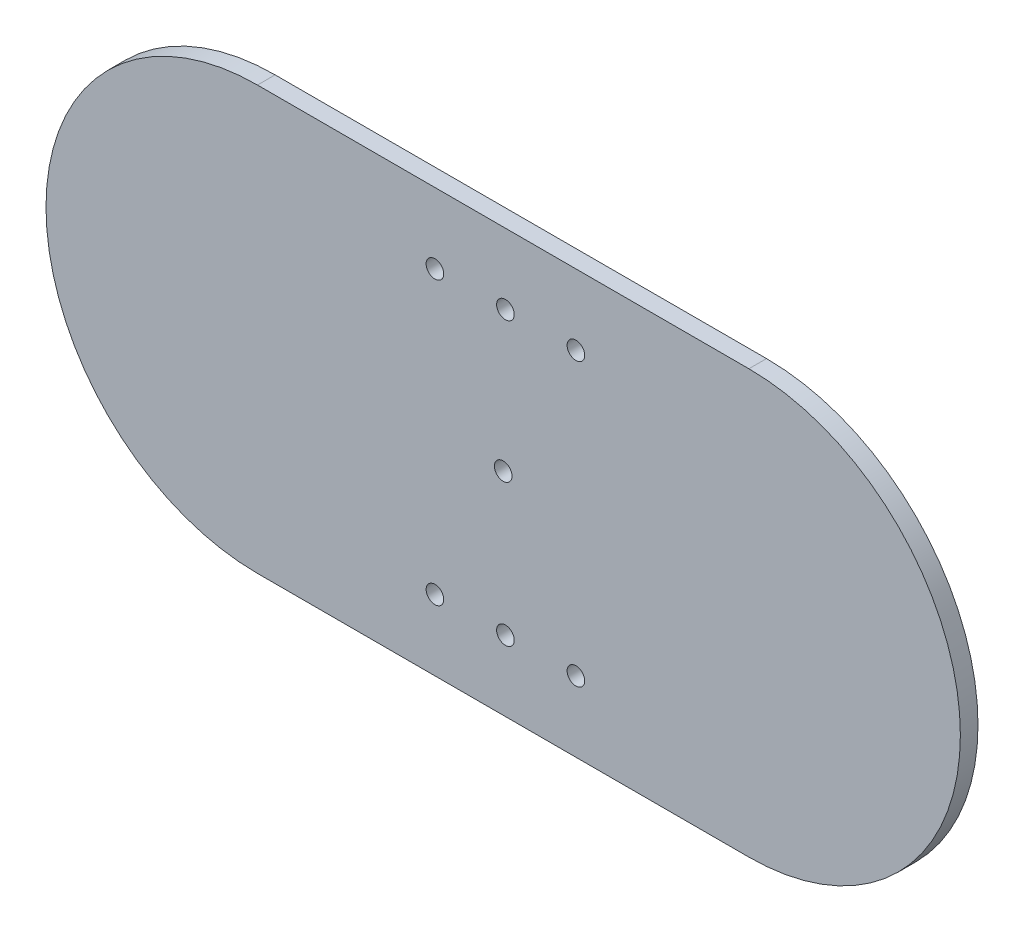
ISO-10303-21;
HEADER;
FILE_DESCRIPTION(('STEP AP214'),'2;1');
FILE_NAME('part.step','',(''),(''),'','','');
FILE_SCHEMA(('AUTOMOTIVE_DESIGN { 1 0 10303 214 1 1 1 1 }'));
ENDSEC;
DATA;
#1=APPLICATION_CONTEXT('core data for automotive mechanical design processes');
#2=APPLICATION_PROTOCOL_DEFINITION('international standard','automotive_design',2000,#1);
#3=PRODUCT_CONTEXT('',#1,'mechanical');
#4=PRODUCT('Part','Part','',(#3));
#5=PRODUCT_RELATED_PRODUCT_CATEGORY('part','',(#4));
#6=PRODUCT_DEFINITION_FORMATION('','',#4);
#7=PRODUCT_DEFINITION_CONTEXT('part definition',#1,'design');
#8=PRODUCT_DEFINITION('design','',#6,#7);
#9=PRODUCT_DEFINITION_SHAPE('','',#8);
#10=(LENGTH_UNIT() NAMED_UNIT(*) SI_UNIT(.MILLI.,.METRE.));
#11=(NAMED_UNIT(*) PLANE_ANGLE_UNIT() SI_UNIT($,.RADIAN.));
#12=(NAMED_UNIT(*) SI_UNIT($,.STERADIAN.) SOLID_ANGLE_UNIT());
#13=UNCERTAINTY_MEASURE_WITH_UNIT(LENGTH_MEASURE(1.E-05),#10,'distance_accuracy_value','');
#14=(GEOMETRIC_REPRESENTATION_CONTEXT(3) GLOBAL_UNCERTAINTY_ASSIGNED_CONTEXT((#13)) GLOBAL_UNIT_ASSIGNED_CONTEXT((#10,
#11,#12)) REPRESENTATION_CONTEXT('',''));
#15=CARTESIAN_POINT('',(0.,0.,0.));
#16=DIRECTION('',(0.,0.,1.));
#17=DIRECTION('',(1.,0.,0.));
#18=AXIS2_PLACEMENT_3D('',#15,#16,#17);
#19=CARTESIAN_POINT('',(-81.1545144804089,0.,6.35));
#20=DIRECTION('',(0.,0.,1.));
#21=DIRECTION('',(1.,0.,0.));
#22=AXIS2_PLACEMENT_3D('',#19,#20,#21);
#23=PLANE('',#22);
#24=CARTESIAN_POINT('',(-17.2157611138345,-50.8,6.35));
#25=DIRECTION('',(0.,0.,1.));
#26=DIRECTION('',(1.,0.,0.));
#27=AXIS2_PLACEMENT_3D('',#24,#25,#26);
#28=CIRCLE('',#27,3.175);
#29=CARTESIAN_POINT('',(-14.0407611138345,-50.8,6.35));
#30=VERTEX_POINT('',#29);
#31=EDGE_CURVE('E147',#30,#30,#28,.T.);
#32=ORIENTED_EDGE('',*,*,#31,.F.);
#33=EDGE_LOOP('',(#32));
#34=FACE_BOUND('',#33,.T.);
#35=CARTESIAN_POINT('',(33.5842388861655,50.8,6.35));
#36=DIRECTION('',(0.,0.,1.));
#37=DIRECTION('',(1.,0.,0.));
#38=AXIS2_PLACEMENT_3D('',#35,#36,#37);
#39=CIRCLE('',#38,3.175);
#40=CARTESIAN_POINT('',(36.7592388861655,50.8,6.35));
#41=VERTEX_POINT('',#40);
#42=EDGE_CURVE('E135',#41,#41,#39,.T.);
#43=ORIENTED_EDGE('',*,*,#42,.F.);
#44=EDGE_LOOP('',(#43));
#45=FACE_BOUND('',#44,.T.);
#46=CARTESIAN_POINT('',(8.18423888616551,-50.8,6.35));
#47=DIRECTION('',(0.,0.,1.));
#48=DIRECTION('',(1.,0.,0.));
#49=AXIS2_PLACEMENT_3D('',#46,#47,#48);
#50=CIRCLE('',#49,3.175);
#51=CARTESIAN_POINT('',(11.3592388861655,-50.8,6.35));
#52=VERTEX_POINT('',#51);
#53=EDGE_CURVE('E123',#52,#52,#50,.T.);
#54=ORIENTED_EDGE('',*,*,#53,.F.);
#55=EDGE_LOOP('',(#54));
#56=FACE_BOUND('',#55,.T.);
#57=CARTESIAN_POINT('',(-81.1545144804089,0.,6.35));
#58=DIRECTION('',(0.,0.,1.));
#59=DIRECTION('',(1.,0.,0.));
#60=AXIS2_PLACEMENT_3D('',#57,#58,#59);
#61=CIRCLE('',#60,76.2);
#62=CARTESIAN_POINT('',(-81.1545144804089,76.2,6.35));
#63=VERTEX_POINT('',#62);
#64=CARTESIAN_POINT('',(-81.1545144804089,-76.2,6.35));
#65=VERTEX_POINT('',#64);
#66=EDGE_CURVE('E93',#63,#65,#61,.T.);
#67=ORIENTED_EDGE('',*,*,#66,.T.);
#68=DIRECTION('',(1.,0.,0.));
#69=VECTOR('',#68,1.);
#70=CARTESIAN_POINT('',(-81.1545144804089,-76.2,6.35));
#71=LINE('',#70,#69);
#72=CARTESIAN_POINT('',(95.9098807495741,-76.2,6.35));
#73=VERTEX_POINT('',#72);
#74=EDGE_CURVE('E88',#65,#73,#71,.T.);
#75=ORIENTED_EDGE('',*,*,#74,.T.);
#76=CARTESIAN_POINT('',(95.9098807495741,0.,6.35));
#77=DIRECTION('',(0.,0.,1.));
#78=DIRECTION('',(1.,0.,0.));
#79=AXIS2_PLACEMENT_3D('',#76,#77,#78);
#80=CIRCLE('',#79,76.2);
#81=CARTESIAN_POINT('',(95.9098807495741,76.2,6.35));
#82=VERTEX_POINT('',#81);
#83=EDGE_CURVE('E91',#73,#82,#80,.T.);
#84=ORIENTED_EDGE('',*,*,#83,.T.);
#85=DIRECTION('',(-1.,0.,0.));
#86=VECTOR('',#85,1.);
#87=CARTESIAN_POINT('',(-81.1545144804089,76.2,6.35));
#88=LINE('',#87,#86);
#89=EDGE_CURVE('E58',#82,#63,#88,.T.);
#90=ORIENTED_EDGE('',*,*,#89,.T.);
#91=EDGE_LOOP('',(#67,#75,#84,#90));
#92=FACE_BOUND('',#91,.T.);
#93=CARTESIAN_POINT('',(8.18423888616551,50.8,6.35));
#94=DIRECTION('',(0.,0.,1.));
#95=DIRECTION('',(1.,0.,0.));
#96=AXIS2_PLACEMENT_3D('',#93,#94,#95);
#97=CIRCLE('',#96,3.175);
#98=CARTESIAN_POINT('',(11.3592388861655,50.8,6.35));
#99=VERTEX_POINT('',#98);
#100=EDGE_CURVE('E108',#99,#99,#97,.T.);
#101=ORIENTED_EDGE('',*,*,#100,.F.);
#102=EDGE_LOOP('',(#101));
#103=FACE_BOUND('',#102,.T.);
#104=CARTESIAN_POINT('',(-17.2157611138345,50.8,6.35));
#105=DIRECTION('',(0.,0.,1.));
#106=DIRECTION('',(1.,0.,0.));
#107=AXIS2_PLACEMENT_3D('',#104,#105,#106);
#108=CIRCLE('',#107,3.175);
#109=CARTESIAN_POINT('',(-14.0407611138345,50.8,6.35));
#110=VERTEX_POINT('',#109);
#111=EDGE_CURVE('E129',#110,#110,#108,.T.);
#112=ORIENTED_EDGE('',*,*,#111,.F.);
#113=EDGE_LOOP('',(#112));
#114=FACE_BOUND('',#113,.T.);
#115=CARTESIAN_POINT('',(33.5842388861655,-50.8,6.35));
#116=DIRECTION('',(0.,0.,1.));
#117=DIRECTION('',(1.,0.,0.));
#118=AXIS2_PLACEMENT_3D('',#115,#116,#117);
#119=CIRCLE('',#118,3.175);
#120=CARTESIAN_POINT('',(36.7592388861655,-50.8,6.35));
#121=VERTEX_POINT('',#120);
#122=EDGE_CURVE('E141',#121,#121,#119,.T.);
#123=ORIENTED_EDGE('',*,*,#122,.F.);
#124=EDGE_LOOP('',(#123));
#125=FACE_BOUND('',#124,.T.);
#126=CARTESIAN_POINT('',(7.3776831345826,0.,6.35));
#127=DIRECTION('',(0.,0.,1.));
#128=DIRECTION('',(1.,0.,0.));
#129=AXIS2_PLACEMENT_3D('',#126,#127,#128);
#130=CIRCLE('',#129,3.175);
#131=CARTESIAN_POINT('',(10.5526831345826,0.,6.35));
#132=VERTEX_POINT('',#131);
#133=EDGE_CURVE('E153',#132,#132,#130,.T.);
#134=ORIENTED_EDGE('',*,*,#133,.F.);
#135=EDGE_LOOP('',(#134));
#136=FACE_BOUND('',#135,.T.);
#137=ADVANCED_FACE('F41',(#34,#45,#56,#92,#103,#114,#125,#136),#23,.T.);
#138=CARTESIAN_POINT('',(-81.1545144804089,0.,0.));
#139=DIRECTION('',(0.,0.,1.));
#140=DIRECTION('',(1.,0.,0.));
#141=AXIS2_PLACEMENT_3D('',#138,#139,#140);
#142=PLANE('',#141);
#143=CARTESIAN_POINT('',(-81.1545144804089,0.,0.));
#144=DIRECTION('',(0.,0.,1.));
#145=DIRECTION('',(1.,0.,0.));
#146=AXIS2_PLACEMENT_3D('',#143,#144,#145);
#147=CIRCLE('',#146,76.2);
#148=CARTESIAN_POINT('',(-81.1545144804089,76.2,0.));
#149=VERTEX_POINT('',#148);
#150=CARTESIAN_POINT('',(-81.1545144804089,-76.2,0.));
#151=VERTEX_POINT('',#150);
#152=EDGE_CURVE('E105',#149,#151,#147,.T.);
#153=ORIENTED_EDGE('',*,*,#152,.F.);
#154=DIRECTION('',(-1.,0.,0.));
#155=VECTOR('',#154,1.);
#156=CARTESIAN_POINT('',(-81.1545144804089,76.2,0.));
#157=LINE('',#156,#155);
#158=CARTESIAN_POINT('',(95.9098807495741,76.2,0.));
#159=VERTEX_POINT('',#158);
#160=EDGE_CURVE('E81',#159,#149,#157,.T.);
#161=ORIENTED_EDGE('',*,*,#160,.F.);
#162=CARTESIAN_POINT('',(95.9098807495741,0.,0.));
#163=DIRECTION('',(0.,0.,1.));
#164=DIRECTION('',(1.,0.,0.));
#165=AXIS2_PLACEMENT_3D('',#162,#163,#164);
#166=CIRCLE('',#165,76.2);
#167=CARTESIAN_POINT('',(95.9098807495741,-76.2,0.));
#168=VERTEX_POINT('',#167);
#169=EDGE_CURVE('E75',#168,#159,#166,.T.);
#170=ORIENTED_EDGE('',*,*,#169,.F.);
#171=DIRECTION('',(1.,0.,0.));
#172=VECTOR('',#171,1.);
#173=CARTESIAN_POINT('',(-81.1545144804089,-76.2,0.));
#174=LINE('',#173,#172);
#175=EDGE_CURVE('E97',#151,#168,#174,.T.);
#176=ORIENTED_EDGE('',*,*,#175,.F.);
#177=EDGE_LOOP('',(#153,#161,#170,#176));
#178=FACE_BOUND('',#177,.T.);
#179=CARTESIAN_POINT('',(8.18423888616551,50.8,0.));
#180=DIRECTION('',(0.,0.,1.));
#181=DIRECTION('',(1.,0.,0.));
#182=AXIS2_PLACEMENT_3D('',#179,#180,#181);
#183=CIRCLE('',#182,3.175);
#184=CARTESIAN_POINT('',(11.3592388861655,50.8,0.));
#185=VERTEX_POINT('',#184);
#186=EDGE_CURVE('E120',#185,#185,#183,.T.);
#187=ORIENTED_EDGE('',*,*,#186,.T.);
#188=EDGE_LOOP('',(#187));
#189=FACE_BOUND('',#188,.T.);
#190=CARTESIAN_POINT('',(8.18423888616551,-50.8,0.));
#191=DIRECTION('',(0.,0.,1.));
#192=DIRECTION('',(1.,0.,0.));
#193=AXIS2_PLACEMENT_3D('',#190,#191,#192);
#194=CIRCLE('',#193,3.175);
#195=CARTESIAN_POINT('',(11.3592388861655,-50.8,0.));
#196=VERTEX_POINT('',#195);
#197=EDGE_CURVE('E126',#196,#196,#194,.T.);
#198=ORIENTED_EDGE('',*,*,#197,.T.);
#199=EDGE_LOOP('',(#198));
#200=FACE_BOUND('',#199,.T.);
#201=CARTESIAN_POINT('',(-17.2157611138345,50.8,0.));
#202=DIRECTION('',(0.,0.,1.));
#203=DIRECTION('',(1.,0.,0.));
#204=AXIS2_PLACEMENT_3D('',#201,#202,#203);
#205=CIRCLE('',#204,3.175);
#206=CARTESIAN_POINT('',(-14.0407611138345,50.8,0.));
#207=VERTEX_POINT('',#206);
#208=EDGE_CURVE('E132',#207,#207,#205,.T.);
#209=ORIENTED_EDGE('',*,*,#208,.T.);
#210=EDGE_LOOP('',(#209));
#211=FACE_BOUND('',#210,.T.);
#212=CARTESIAN_POINT('',(33.5842388861655,50.8,0.));
#213=DIRECTION('',(0.,0.,1.));
#214=DIRECTION('',(1.,0.,0.));
#215=AXIS2_PLACEMENT_3D('',#212,#213,#214);
#216=CIRCLE('',#215,3.175);
#217=CARTESIAN_POINT('',(36.7592388861655,50.8,0.));
#218=VERTEX_POINT('',#217);
#219=EDGE_CURVE('E138',#218,#218,#216,.T.);
#220=ORIENTED_EDGE('',*,*,#219,.T.);
#221=EDGE_LOOP('',(#220));
#222=FACE_BOUND('',#221,.T.);
#223=CARTESIAN_POINT('',(33.5842388861655,-50.8,0.));
#224=DIRECTION('',(0.,0.,1.));
#225=DIRECTION('',(1.,0.,0.));
#226=AXIS2_PLACEMENT_3D('',#223,#224,#225);
#227=CIRCLE('',#226,3.175);
#228=CARTESIAN_POINT('',(36.7592388861655,-50.8,0.));
#229=VERTEX_POINT('',#228);
#230=EDGE_CURVE('E144',#229,#229,#227,.T.);
#231=ORIENTED_EDGE('',*,*,#230,.T.);
#232=EDGE_LOOP('',(#231));
#233=FACE_BOUND('',#232,.T.);
#234=CARTESIAN_POINT('',(-17.2157611138345,-50.8,0.));
#235=DIRECTION('',(0.,0.,1.));
#236=DIRECTION('',(1.,0.,0.));
#237=AXIS2_PLACEMENT_3D('',#234,#235,#236);
#238=CIRCLE('',#237,3.175);
#239=CARTESIAN_POINT('',(-14.0407611138345,-50.8,0.));
#240=VERTEX_POINT('',#239);
#241=EDGE_CURVE('E150',#240,#240,#238,.T.);
#242=ORIENTED_EDGE('',*,*,#241,.T.);
#243=EDGE_LOOP('',(#242));
#244=FACE_BOUND('',#243,.T.);
#245=CARTESIAN_POINT('',(7.3776831345826,0.,0.));
#246=DIRECTION('',(0.,0.,1.));
#247=DIRECTION('',(1.,0.,0.));
#248=AXIS2_PLACEMENT_3D('',#245,#246,#247);
#249=CIRCLE('',#248,3.175);
#250=CARTESIAN_POINT('',(10.5526831345826,0.,0.));
#251=VERTEX_POINT('',#250);
#252=EDGE_CURVE('E156',#251,#251,#249,.T.);
#253=ORIENTED_EDGE('',*,*,#252,.T.);
#254=EDGE_LOOP('',(#253));
#255=FACE_BOUND('',#254,.T.);
#256=ADVANCED_FACE('F116',(#178,#189,#200,#211,#222,#233,#244,#255),#142,.F.);
#257=CARTESIAN_POINT('',(-81.1545144804089,0.,6.35));
#258=DIRECTION('',(0.,0.,-1.));
#259=DIRECTION('',(-1.,0.,0.));
#260=AXIS2_PLACEMENT_3D('',#257,#258,#259);
#261=CYLINDRICAL_SURFACE('',#260,76.2);
#262=ORIENTED_EDGE('',*,*,#152,.T.);
#263=DIRECTION('',(0.,0.,-1.));
#264=VECTOR('',#263,1.);
#265=CARTESIAN_POINT('',(-81.1545144804089,-76.2,6.35));
#266=LINE('',#265,#264);
#267=EDGE_CURVE('E11',#65,#151,#266,.T.);
#268=ORIENTED_EDGE('',*,*,#267,.F.);
#269=ORIENTED_EDGE('',*,*,#66,.F.);
#270=DIRECTION('',(0.,0.,-1.));
#271=VECTOR('',#270,1.);
#272=CARTESIAN_POINT('',(-81.1545144804089,76.2,6.35));
#273=LINE('',#272,#271);
#274=EDGE_CURVE('E101',#63,#149,#273,.T.);
#275=ORIENTED_EDGE('',*,*,#274,.T.);
#276=EDGE_LOOP('',(#262,#268,#269,#275));
#277=FACE_BOUND('',#276,.T.);
#278=ADVANCED_FACE('F43',(#277),#261,.T.);
#279=CARTESIAN_POINT('',(-81.1545144804089,-76.2,6.35));
#280=DIRECTION('',(0.,1.,0.));
#281=DIRECTION('',(0.,0.,1.));
#282=AXIS2_PLACEMENT_3D('',#279,#280,#281);
#283=PLANE('',#282);
#284=ORIENTED_EDGE('',*,*,#175,.T.);
#285=DIRECTION('',(0.,0.,-1.));
#286=VECTOR('',#285,1.);
#287=CARTESIAN_POINT('',(95.9098807495741,-76.2,6.35));
#288=LINE('',#287,#286);
#289=EDGE_CURVE('E50',#73,#168,#288,.T.);
#290=ORIENTED_EDGE('',*,*,#289,.F.);
#291=ORIENTED_EDGE('',*,*,#74,.F.);
#292=ORIENTED_EDGE('',*,*,#267,.T.);
#293=EDGE_LOOP('',(#284,#290,#291,#292));
#294=FACE_BOUND('',#293,.T.);
#295=ADVANCED_FACE('F96',(#294),#283,.F.);
#296=CARTESIAN_POINT('',(95.9098807495741,0.,6.35));
#297=DIRECTION('',(0.,0.,-1.));
#298=DIRECTION('',(-1.,0.,0.));
#299=AXIS2_PLACEMENT_3D('',#296,#297,#298);
#300=CYLINDRICAL_SURFACE('',#299,76.2);
#301=ORIENTED_EDGE('',*,*,#169,.T.);
#302=DIRECTION('',(0.,0.,-1.));
#303=VECTOR('',#302,1.);
#304=CARTESIAN_POINT('',(95.9098807495741,76.2,6.35));
#305=LINE('',#304,#303);
#306=EDGE_CURVE('E98',#82,#159,#305,.T.);
#307=ORIENTED_EDGE('',*,*,#306,.F.);
#308=ORIENTED_EDGE('',*,*,#83,.F.);
#309=ORIENTED_EDGE('',*,*,#289,.T.);
#310=EDGE_LOOP('',(#301,#307,#308,#309));
#311=FACE_BOUND('',#310,.T.);
#312=ADVANCED_FACE('F99',(#311),#300,.T.);
#313=CARTESIAN_POINT('',(-81.1545144804089,76.2,6.35));
#314=DIRECTION('',(0.,-1.,0.));
#315=DIRECTION('',(0.,0.,-1.));
#316=AXIS2_PLACEMENT_3D('',#313,#314,#315);
#317=PLANE('',#316);
#318=ORIENTED_EDGE('',*,*,#160,.T.);
#319=ORIENTED_EDGE('',*,*,#274,.F.);
#320=ORIENTED_EDGE('',*,*,#89,.F.);
#321=ORIENTED_EDGE('',*,*,#306,.T.);
#322=EDGE_LOOP('',(#318,#319,#320,#321));
#323=FACE_BOUND('',#322,.T.);
#324=ADVANCED_FACE('F113',(#323),#317,.F.);
#325=CARTESIAN_POINT('',(8.18423888616551,50.8,6.35));
#326=DIRECTION('',(0.,0.,-1.));
#327=DIRECTION('',(-1.,0.,0.));
#328=AXIS2_PLACEMENT_3D('',#325,#326,#327);
#329=CYLINDRICAL_SURFACE('',#328,3.175);
#330=ORIENTED_EDGE('',*,*,#100,.T.);
#331=EDGE_LOOP('',(#330));
#332=FACE_BOUND('',#331,.T.);
#333=ORIENTED_EDGE('',*,*,#186,.F.);
#334=EDGE_LOOP('',(#333));
#335=FACE_BOUND('',#334,.T.);
#336=ADVANCED_FACE('F175',(#332,#335),#329,.F.);
#337=CARTESIAN_POINT('',(8.18423888616551,-50.8,6.35));
#338=DIRECTION('',(0.,0.,-1.));
#339=DIRECTION('',(-1.,0.,0.));
#340=AXIS2_PLACEMENT_3D('',#337,#338,#339);
#341=CYLINDRICAL_SURFACE('',#340,3.175);
#342=ORIENTED_EDGE('',*,*,#53,.T.);
#343=EDGE_LOOP('',(#342));
#344=FACE_BOUND('',#343,.T.);
#345=ORIENTED_EDGE('',*,*,#197,.F.);
#346=EDGE_LOOP('',(#345));
#347=FACE_BOUND('',#346,.T.);
#348=ADVANCED_FACE('F229',(#344,#347),#341,.F.);
#349=CARTESIAN_POINT('',(-17.2157611138345,50.8,6.35));
#350=DIRECTION('',(0.,0.,-1.));
#351=DIRECTION('',(-1.,0.,0.));
#352=AXIS2_PLACEMENT_3D('',#349,#350,#351);
#353=CYLINDRICAL_SURFACE('',#352,3.175);
#354=ORIENTED_EDGE('',*,*,#111,.T.);
#355=EDGE_LOOP('',(#354));
#356=FACE_BOUND('',#355,.T.);
#357=ORIENTED_EDGE('',*,*,#208,.F.);
#358=EDGE_LOOP('',(#357));
#359=FACE_BOUND('',#358,.T.);
#360=ADVANCED_FACE('F238',(#356,#359),#353,.F.);
#361=CARTESIAN_POINT('',(33.5842388861655,50.8,6.35));
#362=DIRECTION('',(0.,0.,-1.));
#363=DIRECTION('',(-1.,0.,0.));
#364=AXIS2_PLACEMENT_3D('',#361,#362,#363);
#365=CYLINDRICAL_SURFACE('',#364,3.175);
#366=ORIENTED_EDGE('',*,*,#42,.T.);
#367=EDGE_LOOP('',(#366));
#368=FACE_BOUND('',#367,.T.);
#369=ORIENTED_EDGE('',*,*,#219,.F.);
#370=EDGE_LOOP('',(#369));
#371=FACE_BOUND('',#370,.T.);
#372=ADVANCED_FACE('F247',(#368,#371),#365,.F.);
#373=CARTESIAN_POINT('',(33.5842388861655,-50.8,6.35));
#374=DIRECTION('',(0.,0.,-1.));
#375=DIRECTION('',(-1.,0.,0.));
#376=AXIS2_PLACEMENT_3D('',#373,#374,#375);
#377=CYLINDRICAL_SURFACE('',#376,3.175);
#378=ORIENTED_EDGE('',*,*,#122,.T.);
#379=EDGE_LOOP('',(#378));
#380=FACE_BOUND('',#379,.T.);
#381=ORIENTED_EDGE('',*,*,#230,.F.);
#382=EDGE_LOOP('',(#381));
#383=FACE_BOUND('',#382,.T.);
#384=ADVANCED_FACE('F257',(#380,#383),#377,.F.);
#385=CARTESIAN_POINT('',(-17.2157611138345,-50.8,6.35));
#386=DIRECTION('',(0.,0.,-1.));
#387=DIRECTION('',(-1.,0.,0.));
#388=AXIS2_PLACEMENT_3D('',#385,#386,#387);
#389=CYLINDRICAL_SURFACE('',#388,3.175);
#390=ORIENTED_EDGE('',*,*,#31,.T.);
#391=EDGE_LOOP('',(#390));
#392=FACE_BOUND('',#391,.T.);
#393=ORIENTED_EDGE('',*,*,#241,.F.);
#394=EDGE_LOOP('',(#393));
#395=FACE_BOUND('',#394,.T.);
#396=ADVANCED_FACE('F267',(#392,#395),#389,.F.);
#397=CARTESIAN_POINT('',(7.3776831345826,0.,6.35));
#398=DIRECTION('',(0.,0.,-1.));
#399=DIRECTION('',(-1.,0.,0.));
#400=AXIS2_PLACEMENT_3D('',#397,#398,#399);
#401=CYLINDRICAL_SURFACE('',#400,3.175);
#402=ORIENTED_EDGE('',*,*,#133,.T.);
#403=EDGE_LOOP('',(#402));
#404=FACE_BOUND('',#403,.T.);
#405=ORIENTED_EDGE('',*,*,#252,.F.);
#406=EDGE_LOOP('',(#405));
#407=FACE_BOUND('',#406,.T.);
#408=ADVANCED_FACE('F162',(#404,#407),#401,.F.);
#409=CLOSED_SHELL('',(#137,#256,#278,#295,#312,#324,#336,#348,#360,#372,#384,#396,#408));
#410=MANIFOLD_SOLID_BREP('B2',#409);
#411=ADVANCED_BREP_SHAPE_REPRESENTATION('',(#18,#410),#14);
#412=SHAPE_DEFINITION_REPRESENTATION(#9,#411);
ENDSEC;
END-ISO-10303-21;
